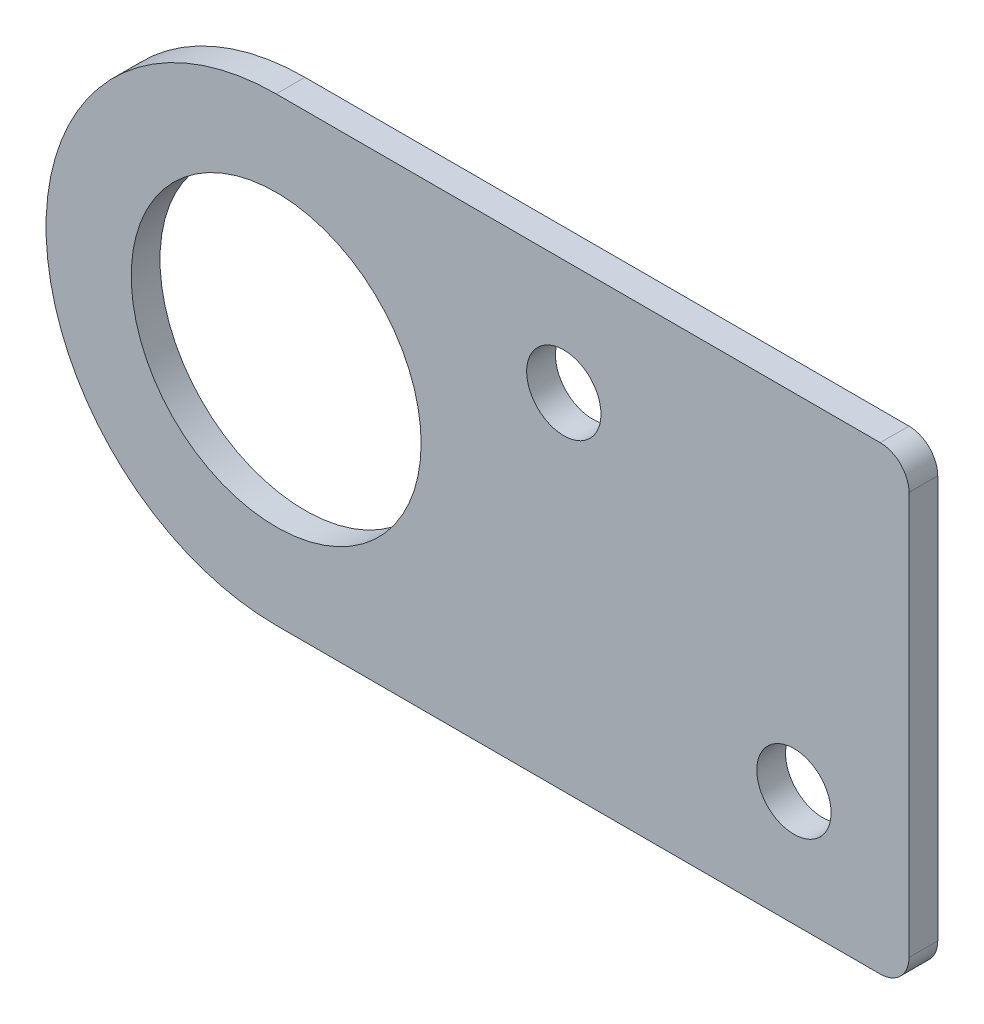
ISO-10303-21;
HEADER;
FILE_DESCRIPTION(('STEP AP214'),'2;1');
FILE_NAME('part.step','',(''),(''),'','','');
FILE_SCHEMA(('AUTOMOTIVE_DESIGN { 1 0 10303 214 1 1 1 1 }'));
ENDSEC;
DATA;
#1=APPLICATION_CONTEXT('core data for automotive mechanical design processes');
#2=APPLICATION_PROTOCOL_DEFINITION('international standard','automotive_design',2000,#1);
#3=PRODUCT_CONTEXT('',#1,'mechanical');
#4=PRODUCT('Part','Part','',(#3));
#5=PRODUCT_RELATED_PRODUCT_CATEGORY('part','',(#4));
#6=PRODUCT_DEFINITION_FORMATION('','',#4);
#7=PRODUCT_DEFINITION_CONTEXT('part definition',#1,'design');
#8=PRODUCT_DEFINITION('design','',#6,#7);
#9=PRODUCT_DEFINITION_SHAPE('','',#8);
#10=(LENGTH_UNIT() NAMED_UNIT(*) SI_UNIT(.MILLI.,.METRE.));
#11=(NAMED_UNIT(*) PLANE_ANGLE_UNIT() SI_UNIT($,.RADIAN.));
#12=(NAMED_UNIT(*) SI_UNIT($,.STERADIAN.) SOLID_ANGLE_UNIT());
#13=UNCERTAINTY_MEASURE_WITH_UNIT(LENGTH_MEASURE(1.E-05),#10,'distance_accuracy_value','');
#14=(GEOMETRIC_REPRESENTATION_CONTEXT(3) GLOBAL_UNCERTAINTY_ASSIGNED_CONTEXT((#13)) GLOBAL_UNIT_ASSIGNED_CONTEXT((#10,
#11,#12)) REPRESENTATION_CONTEXT('',''));
#15=CARTESIAN_POINT('',(0.,0.,0.));
#16=DIRECTION('',(0.,0.,1.));
#17=DIRECTION('',(1.,0.,0.));
#18=AXIS2_PLACEMENT_3D('',#15,#16,#17);
#19=CARTESIAN_POINT('',(0.,-12.7,1.5875));
#20=DIRECTION('',(0.,-1.,0.));
#21=DIRECTION('',(1.,0.,0.));
#22=AXIS2_PLACEMENT_3D('',#19,#20,#21);
#23=PLANE('',#22);
#24=DIRECTION('',(-1.,0.,0.));
#25=VECTOR('',#24,1.);
#26=CARTESIAN_POINT('',(0.,-12.7,0.));
#27=LINE('',#26,#25);
#28=CARTESIAN_POINT('',(-141.2875,-12.7,0.));
#29=VERTEX_POINT('',#28);
#30=CARTESIAN_POINT('',(-174.625,-12.7,0.));
#31=VERTEX_POINT('',#30);
#32=EDGE_CURVE('E133',#29,#31,#27,.T.);
#33=ORIENTED_EDGE('',*,*,#32,.F.);
#34=DIRECTION('',(0.,0.,-1.));
#35=VECTOR('',#34,1.);
#36=CARTESIAN_POINT('',(-141.2875,-12.7,1.5875));
#37=LINE('',#36,#35);
#38=CARTESIAN_POINT('',(-141.2875,-12.7,1.5875));
#39=VERTEX_POINT('',#38);
#40=EDGE_CURVE('E64',#29,#39,#37,.F.);
#41=ORIENTED_EDGE('',*,*,#40,.T.);
#42=DIRECTION('',(-1.,0.,0.));
#43=VECTOR('',#42,1.);
#44=CARTESIAN_POINT('',(0.,-12.7,1.5875));
#45=LINE('',#44,#43);
#46=CARTESIAN_POINT('',(-174.625,-12.7,1.5875));
#47=VERTEX_POINT('',#46);
#48=EDGE_CURVE('E121',#39,#47,#45,.T.);
#49=ORIENTED_EDGE('',*,*,#48,.T.);
#50=DIRECTION('',(0.,0.,-1.));
#51=VECTOR('',#50,1.);
#52=CARTESIAN_POINT('',(-174.625,-12.7,1.5875));
#53=LINE('',#52,#51);
#54=EDGE_CURVE('E107',#47,#31,#53,.T.);
#55=ORIENTED_EDGE('',*,*,#54,.T.);
#56=EDGE_LOOP('',(#33,#41,#49,#55));
#57=FACE_BOUND('',#56,.T.);
#58=ADVANCED_FACE('F41',(#57),#23,.T.);
#59=CARTESIAN_POINT('',(-139.7,0.,1.5875));
#60=DIRECTION('',(1.,0.,0.));
#61=DIRECTION('',(0.,0.,-1.));
#62=AXIS2_PLACEMENT_3D('',#59,#60,#61);
#63=PLANE('',#62);
#64=DIRECTION('',(0.,-1.,0.));
#65=VECTOR('',#64,1.);
#66=CARTESIAN_POINT('',(-139.7,0.,1.5875));
#67=LINE('',#66,#65);
#68=CARTESIAN_POINT('',(-139.7,11.1125,1.5875));
#69=VERTEX_POINT('',#68);
#70=CARTESIAN_POINT('',(-139.7,-11.1125,1.5875));
#71=VERTEX_POINT('',#70);
#72=EDGE_CURVE('E118',#69,#71,#67,.T.);
#73=ORIENTED_EDGE('',*,*,#72,.T.);
#74=DIRECTION('',(0.,0.,-1.));
#75=VECTOR('',#74,1.);
#76=CARTESIAN_POINT('',(-139.7,-11.1125,1.5875));
#77=LINE('',#76,#75);
#78=CARTESIAN_POINT('',(-139.7,-11.1125,0.));
#79=VERTEX_POINT('',#78);
#80=EDGE_CURVE('E150',#71,#79,#77,.T.);
#81=ORIENTED_EDGE('',*,*,#80,.T.);
#82=DIRECTION('',(0.,-1.,0.));
#83=VECTOR('',#82,1.);
#84=CARTESIAN_POINT('',(-139.7,0.,0.));
#85=LINE('',#84,#83);
#86=CARTESIAN_POINT('',(-139.7,11.1125,0.));
#87=VERTEX_POINT('',#86);
#88=EDGE_CURVE('E135',#87,#79,#85,.T.);
#89=ORIENTED_EDGE('',*,*,#88,.F.);
#90=DIRECTION('',(0.,0.,-1.));
#91=VECTOR('',#90,1.);
#92=CARTESIAN_POINT('',(-139.7,11.1125,1.5875));
#93=LINE('',#92,#91);
#94=EDGE_CURVE('E106',#87,#69,#93,.F.);
#95=ORIENTED_EDGE('',*,*,#94,.T.);
#96=EDGE_LOOP('',(#73,#81,#89,#95));
#97=FACE_BOUND('',#96,.T.);
#98=ADVANCED_FACE('F162',(#97),#63,.T.);
#99=CARTESIAN_POINT('',(0.,12.7,1.5875));
#100=DIRECTION('',(0.,1.,0.));
#101=DIRECTION('',(-1.,0.,0.));
#102=AXIS2_PLACEMENT_3D('',#99,#100,#101);
#103=PLANE('',#102);
#104=DIRECTION('',(1.,0.,0.));
#105=VECTOR('',#104,1.);
#106=CARTESIAN_POINT('',(0.,12.7,1.5875));
#107=LINE('',#106,#105);
#108=CARTESIAN_POINT('',(-174.625,12.7,1.5875));
#109=VERTEX_POINT('',#108);
#110=CARTESIAN_POINT('',(-141.2875,12.7,1.5875));
#111=VERTEX_POINT('',#110);
#112=EDGE_CURVE('E99',#109,#111,#107,.T.);
#113=ORIENTED_EDGE('',*,*,#112,.T.);
#114=DIRECTION('',(0.,0.,-1.));
#115=VECTOR('',#114,1.);
#116=CARTESIAN_POINT('',(-141.2875,12.7,1.5875));
#117=LINE('',#116,#115);
#118=CARTESIAN_POINT('',(-141.2875,12.7,0.));
#119=VERTEX_POINT('',#118);
#120=EDGE_CURVE('E11',#111,#119,#117,.T.);
#121=ORIENTED_EDGE('',*,*,#120,.T.);
#122=DIRECTION('',(1.,0.,0.));
#123=VECTOR('',#122,1.);
#124=CARTESIAN_POINT('',(0.,12.7,0.));
#125=LINE('',#124,#123);
#126=CARTESIAN_POINT('',(-174.625,12.7,0.));
#127=VERTEX_POINT('',#126);
#128=EDGE_CURVE('E102',#127,#119,#125,.T.);
#129=ORIENTED_EDGE('',*,*,#128,.F.);
#130=DIRECTION('',(0.,0.,-1.));
#131=VECTOR('',#130,1.);
#132=CARTESIAN_POINT('',(-174.625,12.7,1.5875));
#133=LINE('',#132,#131);
#134=EDGE_CURVE('E96',#109,#127,#133,.T.);
#135=ORIENTED_EDGE('',*,*,#134,.F.);
#136=EDGE_LOOP('',(#113,#121,#129,#135));
#137=FACE_BOUND('',#136,.T.);
#138=ADVANCED_FACE('F98',(#137),#103,.T.);
#139=CARTESIAN_POINT('',(-146.05,-6.35,1.5875));
#140=DIRECTION('',(0.,0.,-1.));
#141=DIRECTION('',(-1.,0.,0.));
#142=AXIS2_PLACEMENT_3D('',#139,#140,#141);
#143=CYLINDRICAL_SURFACE('',#142,2.04999999999999);
#144=CARTESIAN_POINT('',(-146.05,-6.35,1.5875));
#145=DIRECTION('',(0.,0.,1.));
#146=DIRECTION('',(1.,0.,0.));
#147=AXIS2_PLACEMENT_3D('',#144,#145,#146);
#148=CIRCLE('',#147,2.04999999999999);
#149=CARTESIAN_POINT('',(-144.,-6.35,1.5875));
#150=VERTEX_POINT('',#149);
#151=EDGE_CURVE('E114',#150,#150,#148,.T.);
#152=ORIENTED_EDGE('',*,*,#151,.T.);
#153=EDGE_LOOP('',(#152));
#154=FACE_BOUND('',#153,.T.);
#155=CARTESIAN_POINT('',(-146.05,-6.35,0.));
#156=DIRECTION('',(0.,0.,1.));
#157=DIRECTION('',(1.,0.,0.));
#158=AXIS2_PLACEMENT_3D('',#155,#156,#157);
#159=CIRCLE('',#158,2.04999999999999);
#160=CARTESIAN_POINT('',(-144.,-6.35,0.));
#161=VERTEX_POINT('',#160);
#162=EDGE_CURVE('E141',#161,#161,#159,.T.);
#163=ORIENTED_EDGE('',*,*,#162,.F.);
#164=EDGE_LOOP('',(#163));
#165=FACE_BOUND('',#164,.T.);
#166=ADVANCED_FACE('F192',(#154,#165),#143,.F.);
#167=CARTESIAN_POINT('',(-174.625,0.,1.5875));
#168=DIRECTION('',(0.,0.,-1.));
#169=DIRECTION('',(-1.,0.,0.));
#170=AXIS2_PLACEMENT_3D('',#167,#168,#169);
#171=CYLINDRICAL_SURFACE('',#170,12.7);
#172=CARTESIAN_POINT('',(-174.625,0.,0.));
#173=DIRECTION('',(0.,0.,1.));
#174=DIRECTION('',(1.,0.,0.));
#175=AXIS2_PLACEMENT_3D('',#172,#173,#174);
#176=CIRCLE('',#175,12.7);
#177=EDGE_CURVE('E139',#127,#31,#176,.T.);
#178=ORIENTED_EDGE('',*,*,#177,.T.);
#179=ORIENTED_EDGE('',*,*,#54,.F.);
#180=CARTESIAN_POINT('',(-174.625,0.,1.5875));
#181=DIRECTION('',(0.,0.,1.));
#182=DIRECTION('',(1.,0.,0.));
#183=AXIS2_PLACEMENT_3D('',#180,#181,#182);
#184=CIRCLE('',#183,12.7);
#185=EDGE_CURVE('E111',#109,#47,#184,.T.);
#186=ORIENTED_EDGE('',*,*,#185,.F.);
#187=ORIENTED_EDGE('',*,*,#134,.T.);
#188=EDGE_LOOP('',(#178,#179,#186,#187));
#189=FACE_BOUND('',#188,.T.);
#190=ADVANCED_FACE('F112',(#189),#171,.T.);
#191=CARTESIAN_POINT('',(-174.625,0.,1.5875));
#192=DIRECTION('',(0.,0.,-1.));
#193=DIRECTION('',(-1.,0.,0.));
#194=AXIS2_PLACEMENT_3D('',#191,#192,#193);
#195=CYLINDRICAL_SURFACE('',#194,8.00000000000001);
#196=CARTESIAN_POINT('',(-174.625,0.,1.5875));
#197=DIRECTION('',(0.,0.,1.));
#198=DIRECTION('',(1.,0.,0.));
#199=AXIS2_PLACEMENT_3D('',#196,#197,#198);
#200=CIRCLE('',#199,8.00000000000001);
#201=CARTESIAN_POINT('',(-166.625,0.,1.5875));
#202=VERTEX_POINT('',#201);
#203=EDGE_CURVE('E147',#202,#202,#200,.T.);
#204=ORIENTED_EDGE('',*,*,#203,.T.);
#205=EDGE_LOOP('',(#204));
#206=FACE_BOUND('',#205,.T.);
#207=CARTESIAN_POINT('',(-174.625,0.,0.));
#208=DIRECTION('',(0.,0.,1.));
#209=DIRECTION('',(1.,0.,0.));
#210=AXIS2_PLACEMENT_3D('',#207,#208,#209);
#211=CIRCLE('',#210,8.00000000000001);
#212=CARTESIAN_POINT('',(-166.625,0.,0.));
#213=VERTEX_POINT('',#212);
#214=EDGE_CURVE('E130',#213,#213,#211,.T.);
#215=ORIENTED_EDGE('',*,*,#214,.F.);
#216=EDGE_LOOP('',(#215));
#217=FACE_BOUND('',#216,.T.);
#218=ADVANCED_FACE('F183',(#206,#217),#195,.F.);
#219=CARTESIAN_POINT('',(-158.75,6.35,1.5875));
#220=DIRECTION('',(0.,0.,-1.));
#221=DIRECTION('',(-1.,0.,0.));
#222=AXIS2_PLACEMENT_3D('',#219,#220,#221);
#223=CYLINDRICAL_SURFACE('',#222,2.04999999999999);
#224=CARTESIAN_POINT('',(-158.75,6.35,1.5875));
#225=DIRECTION('',(0.,0.,1.));
#226=DIRECTION('',(1.,0.,0.));
#227=AXIS2_PLACEMENT_3D('',#224,#225,#226);
#228=CIRCLE('',#227,2.04999999999999);
#229=CARTESIAN_POINT('',(-156.7,6.35,1.5875));
#230=VERTEX_POINT('',#229);
#231=EDGE_CURVE('E127',#230,#230,#228,.T.);
#232=ORIENTED_EDGE('',*,*,#231,.T.);
#233=EDGE_LOOP('',(#232));
#234=FACE_BOUND('',#233,.T.);
#235=CARTESIAN_POINT('',(-158.75,6.35,0.));
#236=DIRECTION('',(0.,0.,1.));
#237=DIRECTION('',(1.,0.,0.));
#238=AXIS2_PLACEMENT_3D('',#235,#236,#237);
#239=CIRCLE('',#238,2.04999999999999);
#240=CARTESIAN_POINT('',(-156.7,6.35,0.));
#241=VERTEX_POINT('',#240);
#242=EDGE_CURVE('E144',#241,#241,#239,.T.);
#243=ORIENTED_EDGE('',*,*,#242,.F.);
#244=EDGE_LOOP('',(#243));
#245=FACE_BOUND('',#244,.T.);
#246=ADVANCED_FACE('F185',(#234,#245),#223,.F.);
#247=CARTESIAN_POINT('',(0.,0.,1.5875));
#248=DIRECTION('',(0.,0.,1.));
#249=DIRECTION('',(1.,0.,0.));
#250=AXIS2_PLACEMENT_3D('',#247,#248,#249);
#251=PLANE('',#250);
#252=ORIENTED_EDGE('',*,*,#203,.F.);
#253=EDGE_LOOP('',(#252));
#254=FACE_BOUND('',#253,.T.);
#255=ORIENTED_EDGE('',*,*,#48,.F.);
#256=CARTESIAN_POINT('',(-141.2875,-11.1125,1.5875));
#257=DIRECTION('',(0.,0.,1.));
#258=DIRECTION('',(1.,0.,0.));
#259=AXIS2_PLACEMENT_3D('',#256,#257,#258);
#260=CIRCLE('',#259,1.5875);
#261=EDGE_CURVE('E49',#39,#71,#260,.T.);
#262=ORIENTED_EDGE('',*,*,#261,.T.);
#263=ORIENTED_EDGE('',*,*,#72,.F.);
#264=CARTESIAN_POINT('',(-141.2875,11.1125,1.5875));
#265=DIRECTION('',(0.,0.,1.));
#266=DIRECTION('',(1.,0.,0.));
#267=AXIS2_PLACEMENT_3D('',#264,#265,#266);
#268=CIRCLE('',#267,1.5875);
#269=EDGE_CURVE('E56',#69,#111,#268,.T.);
#270=ORIENTED_EDGE('',*,*,#269,.T.);
#271=ORIENTED_EDGE('',*,*,#112,.F.);
#272=ORIENTED_EDGE('',*,*,#185,.T.);
#273=EDGE_LOOP('',(#255,#262,#263,#270,#271,#272));
#274=FACE_BOUND('',#273,.T.);
#275=ORIENTED_EDGE('',*,*,#151,.F.);
#276=EDGE_LOOP('',(#275));
#277=FACE_BOUND('',#276,.T.);
#278=ORIENTED_EDGE('',*,*,#231,.F.);
#279=EDGE_LOOP('',(#278));
#280=FACE_BOUND('',#279,.T.);
#281=ADVANCED_FACE('F116',(#254,#274,#277,#280),#251,.T.);
#282=CARTESIAN_POINT('',(0.,0.,0.));
#283=DIRECTION('',(0.,0.,1.));
#284=DIRECTION('',(1.,0.,0.));
#285=AXIS2_PLACEMENT_3D('',#282,#283,#284);
#286=PLANE('',#285);
#287=ORIENTED_EDGE('',*,*,#214,.T.);
#288=EDGE_LOOP('',(#287));
#289=FACE_BOUND('',#288,.T.);
#290=ORIENTED_EDGE('',*,*,#88,.T.);
#291=CARTESIAN_POINT('',(-141.2875,-11.1125,0.));
#292=DIRECTION('',(0.,0.,1.));
#293=DIRECTION('',(1.,0.,0.));
#294=AXIS2_PLACEMENT_3D('',#291,#292,#293);
#295=CIRCLE('',#294,1.5875);
#296=EDGE_CURVE('E155',#79,#29,#295,.F.);
#297=ORIENTED_EDGE('',*,*,#296,.T.);
#298=ORIENTED_EDGE('',*,*,#32,.T.);
#299=ORIENTED_EDGE('',*,*,#177,.F.);
#300=ORIENTED_EDGE('',*,*,#128,.T.);
#301=CARTESIAN_POINT('',(-141.2875,11.1125,0.));
#302=DIRECTION('',(0.,0.,1.));
#303=DIRECTION('',(1.,0.,0.));
#304=AXIS2_PLACEMENT_3D('',#301,#302,#303);
#305=CIRCLE('',#304,1.5875);
#306=EDGE_CURVE('E153',#119,#87,#305,.F.);
#307=ORIENTED_EDGE('',*,*,#306,.T.);
#308=EDGE_LOOP('',(#290,#297,#298,#299,#300,#307));
#309=FACE_BOUND('',#308,.T.);
#310=ORIENTED_EDGE('',*,*,#162,.T.);
#311=EDGE_LOOP('',(#310));
#312=FACE_BOUND('',#311,.T.);
#313=ORIENTED_EDGE('',*,*,#242,.T.);
#314=EDGE_LOOP('',(#313));
#315=FACE_BOUND('',#314,.T.);
#316=ADVANCED_FACE('F167',(#289,#309,#312,#315),#286,.F.);
#317=CARTESIAN_POINT('',(-141.2875,-11.1125,1.5875));
#318=DIRECTION('',(0.,0.,-1.));
#319=DIRECTION('',(-1.,0.,0.));
#320=AXIS2_PLACEMENT_3D('',#317,#318,#319);
#321=CYLINDRICAL_SURFACE('',#320,1.5875);
#322=ORIENTED_EDGE('',*,*,#261,.F.);
#323=ORIENTED_EDGE('',*,*,#40,.F.);
#324=ORIENTED_EDGE('',*,*,#296,.F.);
#325=ORIENTED_EDGE('',*,*,#80,.F.);
#326=EDGE_LOOP('',(#322,#323,#324,#325));
#327=FACE_BOUND('',#326,.T.);
#328=ADVANCED_FACE('F165',(#327),#321,.T.);
#329=CARTESIAN_POINT('',(-141.2875,11.1125,1.5875));
#330=DIRECTION('',(0.,0.,-1.));
#331=DIRECTION('',(-1.,0.,0.));
#332=AXIS2_PLACEMENT_3D('',#329,#330,#331);
#333=CYLINDRICAL_SURFACE('',#332,1.5875);
#334=ORIENTED_EDGE('',*,*,#269,.F.);
#335=ORIENTED_EDGE('',*,*,#94,.F.);
#336=ORIENTED_EDGE('',*,*,#306,.F.);
#337=ORIENTED_EDGE('',*,*,#120,.F.);
#338=EDGE_LOOP('',(#334,#335,#336,#337));
#339=FACE_BOUND('',#338,.T.);
#340=ADVANCED_FACE('F43',(#339),#333,.T.);
#341=CLOSED_SHELL('',(#58,#98,#138,#166,#190,#218,#246,#281,#316,#328,#340));
#342=MANIFOLD_SOLID_BREP('B2',#341);
#343=ADVANCED_BREP_SHAPE_REPRESENTATION('',(#18,#342),#14);
#344=SHAPE_DEFINITION_REPRESENTATION(#9,#343);
ENDSEC;
END-ISO-10303-21;
